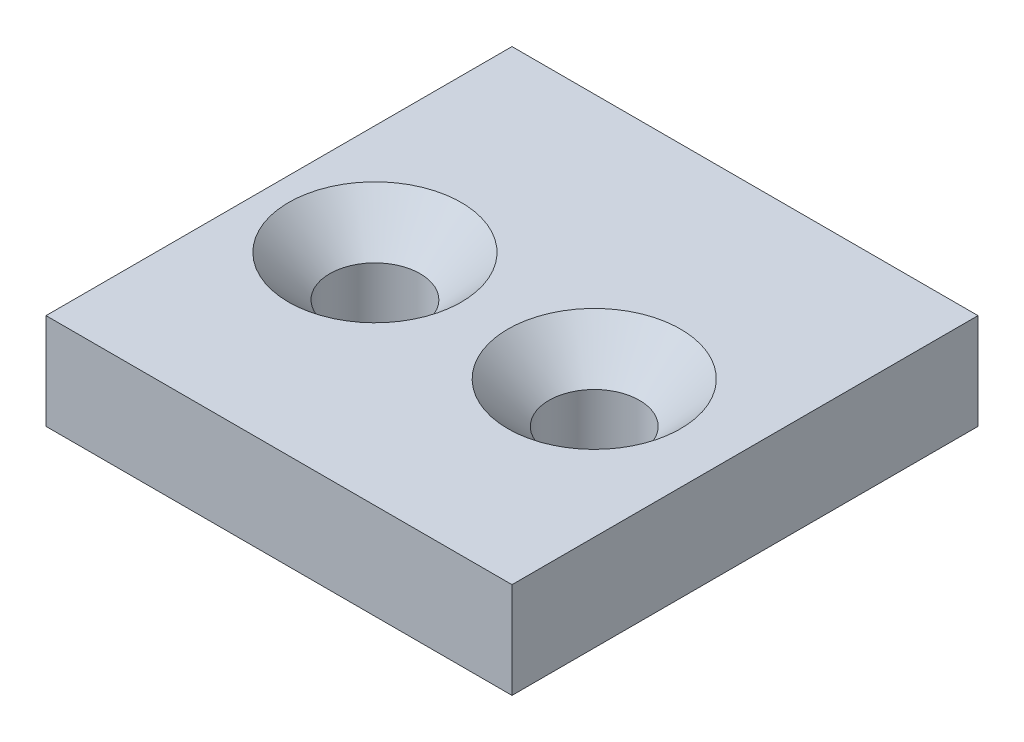
ISO-10303-21;
HEADER;
FILE_DESCRIPTION(('STEP AP214'),'2;1');
FILE_NAME('part.step','',(''),(''),'','','');
FILE_SCHEMA(('AUTOMOTIVE_DESIGN { 1 0 10303 214 1 1 1 1 }'));
ENDSEC;
DATA;
#1=APPLICATION_CONTEXT('core data for automotive mechanical design processes');
#2=APPLICATION_PROTOCOL_DEFINITION('international standard','automotive_design',2000,#1);
#3=PRODUCT_CONTEXT('',#1,'mechanical');
#4=PRODUCT('Part','Part','',(#3));
#5=PRODUCT_RELATED_PRODUCT_CATEGORY('part','',(#4));
#6=PRODUCT_DEFINITION_FORMATION('','',#4);
#7=PRODUCT_DEFINITION_CONTEXT('part definition',#1,'design');
#8=PRODUCT_DEFINITION('design','',#6,#7);
#9=PRODUCT_DEFINITION_SHAPE('','',#8);
#10=(LENGTH_UNIT() NAMED_UNIT(*) SI_UNIT(.MILLI.,.METRE.));
#11=(NAMED_UNIT(*) PLANE_ANGLE_UNIT() SI_UNIT($,.RADIAN.));
#12=(NAMED_UNIT(*) SI_UNIT($,.STERADIAN.) SOLID_ANGLE_UNIT());
#13=UNCERTAINTY_MEASURE_WITH_UNIT(LENGTH_MEASURE(1.E-05),#10,'distance_accuracy_value','');
#14=(GEOMETRIC_REPRESENTATION_CONTEXT(3) GLOBAL_UNCERTAINTY_ASSIGNED_CONTEXT((#13)) GLOBAL_UNIT_ASSIGNED_CONTEXT((#10,
#11,#12)) REPRESENTATION_CONTEXT('',''));
#15=CARTESIAN_POINT('',(0.,0.,0.));
#16=DIRECTION('',(0.,0.,1.));
#17=DIRECTION('',(1.,0.,0.));
#18=AXIS2_PLACEMENT_3D('',#15,#16,#17);
#19=CARTESIAN_POINT('',(0.,7.,0.));
#20=DIRECTION('',(0.,-1.,0.));
#21=DIRECTION('',(0.,0.,-1.));
#22=AXIS2_PLACEMENT_3D('',#19,#20,#21);
#23=PLANE('',#22);
#24=CARTESIAN_POINT('',(24.,7.,-16.));
#25=DIRECTION('',(0.,1.,0.));
#26=DIRECTION('',(0.,0.,1.));
#27=AXIS2_PLACEMENT_3D('',#24,#25,#26);
#28=CIRCLE('',#27,6.3);
#29=CARTESIAN_POINT('',(24.,7.,-9.7));
#30=VERTEX_POINT('',#29);
#31=EDGE_CURVE('E120',#30,#30,#28,.T.);
#32=ORIENTED_EDGE('',*,*,#31,.F.);
#33=EDGE_LOOP('',(#32));
#34=FACE_BOUND('',#33,.T.);
#35=DIRECTION('',(0.,0.,1.));
#36=VECTOR('',#35,1.);
#37=CARTESIAN_POINT('',(0.,7.,0.));
#38=LINE('',#37,#36);
#39=CARTESIAN_POINT('',(0.,7.,-34.));
#40=VERTEX_POINT('',#39);
#41=CARTESIAN_POINT('',(0.,7.,0.));
#42=VERTEX_POINT('',#41);
#43=EDGE_CURVE('E89',#40,#42,#38,.T.);
#44=ORIENTED_EDGE('',*,*,#43,.T.);
#45=DIRECTION('',(1.,0.,0.));
#46=VECTOR('',#45,1.);
#47=CARTESIAN_POINT('',(0.,7.,0.));
#48=LINE('',#47,#46);
#49=CARTESIAN_POINT('',(34.,7.,0.));
#50=VERTEX_POINT('',#49);
#51=EDGE_CURVE('E84',#42,#50,#48,.T.);
#52=ORIENTED_EDGE('',*,*,#51,.T.);
#53=DIRECTION('',(0.,0.,-1.));
#54=VECTOR('',#53,1.);
#55=CARTESIAN_POINT('',(34.,7.,0.));
#56=LINE('',#55,#54);
#57=CARTESIAN_POINT('',(34.,7.,-34.));
#58=VERTEX_POINT('',#57);
#59=EDGE_CURVE('E87',#50,#58,#56,.T.);
#60=ORIENTED_EDGE('',*,*,#59,.T.);
#61=DIRECTION('',(-1.,0.,0.));
#62=VECTOR('',#61,1.);
#63=CARTESIAN_POINT('',(0.,7.,-34.));
#64=LINE('',#63,#62);
#65=EDGE_CURVE('E54',#58,#40,#64,.T.);
#66=ORIENTED_EDGE('',*,*,#65,.T.);
#67=EDGE_LOOP('',(#44,#52,#60,#66));
#68=FACE_BOUND('',#67,.T.);
#69=CARTESIAN_POINT('',(8.,7.,-16.));
#70=DIRECTION('',(0.,1.,0.));
#71=DIRECTION('',(0.,0.,1.));
#72=AXIS2_PLACEMENT_3D('',#69,#70,#71);
#73=CIRCLE('',#72,6.3);
#74=CARTESIAN_POINT('',(8.,7.,-9.7));
#75=VERTEX_POINT('',#74);
#76=EDGE_CURVE('E129',#75,#75,#73,.T.);
#77=ORIENTED_EDGE('',*,*,#76,.F.);
#78=EDGE_LOOP('',(#77));
#79=FACE_BOUND('',#78,.T.);
#80=ADVANCED_FACE('F37',(#34,#68,#79),#23,.F.);
#81=CARTESIAN_POINT('',(0.,7.,0.));
#82=DIRECTION('',(1.,0.,0.));
#83=DIRECTION('',(0.,0.,-1.));
#84=AXIS2_PLACEMENT_3D('',#81,#82,#83);
#85=PLANE('',#84);
#86=DIRECTION('',(0.,0.,1.));
#87=VECTOR('',#86,1.);
#88=CARTESIAN_POINT('',(0.,0.,0.));
#89=LINE('',#88,#87);
#90=CARTESIAN_POINT('',(0.,0.,-34.));
#91=VERTEX_POINT('',#90);
#92=CARTESIAN_POINT('',(0.,0.,0.));
#93=VERTEX_POINT('',#92);
#94=EDGE_CURVE('E101',#91,#93,#89,.T.);
#95=ORIENTED_EDGE('',*,*,#94,.T.);
#96=DIRECTION('',(0.,-1.,0.));
#97=VECTOR('',#96,1.);
#98=CARTESIAN_POINT('',(0.,7.,0.));
#99=LINE('',#98,#97);
#100=EDGE_CURVE('E11',#42,#93,#99,.T.);
#101=ORIENTED_EDGE('',*,*,#100,.F.);
#102=ORIENTED_EDGE('',*,*,#43,.F.);
#103=DIRECTION('',(0.,-1.,0.));
#104=VECTOR('',#103,1.);
#105=CARTESIAN_POINT('',(0.,7.,-34.));
#106=LINE('',#105,#104);
#107=EDGE_CURVE('E97',#40,#91,#106,.T.);
#108=ORIENTED_EDGE('',*,*,#107,.T.);
#109=EDGE_LOOP('',(#95,#101,#102,#108));
#110=FACE_BOUND('',#109,.T.);
#111=ADVANCED_FACE('F39',(#110),#85,.F.);
#112=CARTESIAN_POINT('',(0.,7.,0.));
#113=DIRECTION('',(0.,0.,-1.));
#114=DIRECTION('',(-1.,0.,0.));
#115=AXIS2_PLACEMENT_3D('',#112,#113,#114);
#116=PLANE('',#115);
#117=DIRECTION('',(1.,0.,0.));
#118=VECTOR('',#117,1.);
#119=CARTESIAN_POINT('',(0.,0.,0.));
#120=LINE('',#119,#118);
#121=CARTESIAN_POINT('',(34.,0.,0.));
#122=VERTEX_POINT('',#121);
#123=EDGE_CURVE('E93',#93,#122,#120,.T.);
#124=ORIENTED_EDGE('',*,*,#123,.T.);
#125=DIRECTION('',(0.,-1.,0.));
#126=VECTOR('',#125,1.);
#127=CARTESIAN_POINT('',(34.,7.,0.));
#128=LINE('',#127,#126);
#129=EDGE_CURVE('E46',#50,#122,#128,.T.);
#130=ORIENTED_EDGE('',*,*,#129,.F.);
#131=ORIENTED_EDGE('',*,*,#51,.F.);
#132=ORIENTED_EDGE('',*,*,#100,.T.);
#133=EDGE_LOOP('',(#124,#130,#131,#132));
#134=FACE_BOUND('',#133,.T.);
#135=ADVANCED_FACE('F92',(#134),#116,.F.);
#136=CARTESIAN_POINT('',(34.,7.,0.));
#137=DIRECTION('',(-1.,0.,0.));
#138=DIRECTION('',(0.,0.,1.));
#139=AXIS2_PLACEMENT_3D('',#136,#137,#138);
#140=PLANE('',#139);
#141=DIRECTION('',(0.,0.,-1.));
#142=VECTOR('',#141,1.);
#143=CARTESIAN_POINT('',(34.,0.,0.));
#144=LINE('',#143,#142);
#145=CARTESIAN_POINT('',(34.,0.,-34.));
#146=VERTEX_POINT('',#145);
#147=EDGE_CURVE('E71',#122,#146,#144,.T.);
#148=ORIENTED_EDGE('',*,*,#147,.T.);
#149=DIRECTION('',(0.,-1.,0.));
#150=VECTOR('',#149,1.);
#151=CARTESIAN_POINT('',(34.,7.,-34.));
#152=LINE('',#151,#150);
#153=EDGE_CURVE('E94',#58,#146,#152,.T.);
#154=ORIENTED_EDGE('',*,*,#153,.F.);
#155=ORIENTED_EDGE('',*,*,#59,.F.);
#156=ORIENTED_EDGE('',*,*,#129,.T.);
#157=EDGE_LOOP('',(#148,#154,#155,#156));
#158=FACE_BOUND('',#157,.T.);
#159=ADVANCED_FACE('F95',(#158),#140,.F.);
#160=CARTESIAN_POINT('',(0.,7.,-34.));
#161=DIRECTION('',(0.,0.,1.));
#162=DIRECTION('',(1.,0.,0.));
#163=AXIS2_PLACEMENT_3D('',#160,#161,#162);
#164=PLANE('',#163);
#165=DIRECTION('',(-1.,0.,0.));
#166=VECTOR('',#165,1.);
#167=CARTESIAN_POINT('',(0.,0.,-34.));
#168=LINE('',#167,#166);
#169=EDGE_CURVE('E77',#146,#91,#168,.T.);
#170=ORIENTED_EDGE('',*,*,#169,.T.);
#171=ORIENTED_EDGE('',*,*,#107,.F.);
#172=ORIENTED_EDGE('',*,*,#65,.F.);
#173=ORIENTED_EDGE('',*,*,#153,.T.);
#174=EDGE_LOOP('',(#170,#171,#172,#173));
#175=FACE_BOUND('',#174,.T.);
#176=ADVANCED_FACE('F109',(#175),#164,.F.);
#177=CARTESIAN_POINT('',(0.,0.,0.));
#178=DIRECTION('',(0.,-1.,0.));
#179=DIRECTION('',(0.,0.,-1.));
#180=AXIS2_PLACEMENT_3D('',#177,#178,#179);
#181=PLANE('',#180);
#182=CARTESIAN_POINT('',(8.,0.,-16.));
#183=DIRECTION('',(0.,1.,0.));
#184=DIRECTION('',(0.,0.,1.));
#185=AXIS2_PLACEMENT_3D('',#182,#183,#184);
#186=CIRCLE('',#185,3.3);
#187=CARTESIAN_POINT('',(8.,0.,-12.7));
#188=VERTEX_POINT('',#187);
#189=EDGE_CURVE('E123',#188,#188,#186,.T.);
#190=ORIENTED_EDGE('',*,*,#189,.T.);
#191=EDGE_LOOP('',(#190));
#192=FACE_BOUND('',#191,.T.);
#193=CARTESIAN_POINT('',(24.,0.,-16.));
#194=DIRECTION('',(0.,1.,0.));
#195=DIRECTION('',(0.,0.,1.));
#196=AXIS2_PLACEMENT_3D('',#193,#194,#195);
#197=CIRCLE('',#196,3.3);
#198=CARTESIAN_POINT('',(24.,0.,-12.7));
#199=VERTEX_POINT('',#198);
#200=EDGE_CURVE('E104',#199,#199,#197,.T.);
#201=ORIENTED_EDGE('',*,*,#200,.T.);
#202=EDGE_LOOP('',(#201));
#203=FACE_BOUND('',#202,.T.);
#204=ORIENTED_EDGE('',*,*,#94,.F.);
#205=ORIENTED_EDGE('',*,*,#169,.F.);
#206=ORIENTED_EDGE('',*,*,#147,.F.);
#207=ORIENTED_EDGE('',*,*,#123,.F.);
#208=EDGE_LOOP('',(#204,#205,#206,#207));
#209=FACE_BOUND('',#208,.T.);
#210=ADVANCED_FACE('F112',(#192,#203,#209),#181,.T.);
#211=CARTESIAN_POINT('',(24.,7.,-16.));
#212=DIRECTION('',(0.,1.,0.));
#213=DIRECTION('',(0.,0.,1.));
#214=AXIS2_PLACEMENT_3D('',#211,#212,#213);
#215=CYLINDRICAL_SURFACE('',#214,3.3);
#216=ORIENTED_EDGE('',*,*,#200,.F.);
#217=EDGE_LOOP('',(#216));
#218=FACE_BOUND('',#217,.T.);
#219=CARTESIAN_POINT('',(24.,4.,-16.));
#220=DIRECTION('',(0.,1.,0.));
#221=DIRECTION('',(0.,0.,1.));
#222=AXIS2_PLACEMENT_3D('',#219,#220,#221);
#223=CIRCLE('',#222,3.3);
#224=CARTESIAN_POINT('',(24.,4.,-12.7));
#225=VERTEX_POINT('',#224);
#226=EDGE_CURVE('E117',#225,#225,#223,.T.);
#227=ORIENTED_EDGE('',*,*,#226,.T.);
#228=EDGE_LOOP('',(#227));
#229=FACE_BOUND('',#228,.T.);
#230=ADVANCED_FACE('F143',(#218,#229),#215,.F.);
#231=CARTESIAN_POINT('',(24.,7.,-16.));
#232=DIRECTION('',(0.,1.,0.));
#233=DIRECTION('',(0.,0.,1.));
#234=AXIS2_PLACEMENT_3D('',#231,#232,#233);
#235=CONICAL_SURFACE('',#234,6.3,0.785398163397448);
#236=ORIENTED_EDGE('',*,*,#226,.F.);
#237=EDGE_LOOP('',(#236));
#238=FACE_BOUND('',#237,.T.);
#239=ORIENTED_EDGE('',*,*,#31,.T.);
#240=EDGE_LOOP('',(#239));
#241=FACE_BOUND('',#240,.T.);
#242=ADVANCED_FACE('F174',(#238,#241),#235,.F.);
#243=CARTESIAN_POINT('',(8.,7.,-16.));
#244=DIRECTION('',(0.,1.,0.));
#245=DIRECTION('',(0.,0.,1.));
#246=AXIS2_PLACEMENT_3D('',#243,#244,#245);
#247=CYLINDRICAL_SURFACE('',#246,3.3);
#248=ORIENTED_EDGE('',*,*,#189,.F.);
#249=EDGE_LOOP('',(#248));
#250=FACE_BOUND('',#249,.T.);
#251=CARTESIAN_POINT('',(8.,4.,-16.));
#252=DIRECTION('',(0.,1.,0.));
#253=DIRECTION('',(0.,0.,1.));
#254=AXIS2_PLACEMENT_3D('',#251,#252,#253);
#255=CIRCLE('',#254,3.3);
#256=CARTESIAN_POINT('',(8.,4.,-12.7));
#257=VERTEX_POINT('',#256);
#258=EDGE_CURVE('E126',#257,#257,#255,.T.);
#259=ORIENTED_EDGE('',*,*,#258,.T.);
#260=EDGE_LOOP('',(#259));
#261=FACE_BOUND('',#260,.T.);
#262=ADVANCED_FACE('F181',(#250,#261),#247,.F.);
#263=CARTESIAN_POINT('',(8.,7.,-16.));
#264=DIRECTION('',(0.,1.,0.));
#265=DIRECTION('',(0.,0.,1.));
#266=AXIS2_PLACEMENT_3D('',#263,#264,#265);
#267=CONICAL_SURFACE('',#266,6.3,0.785398163397448);
#268=ORIENTED_EDGE('',*,*,#258,.F.);
#269=EDGE_LOOP('',(#268));
#270=FACE_BOUND('',#269,.T.);
#271=ORIENTED_EDGE('',*,*,#76,.T.);
#272=EDGE_LOOP('',(#271));
#273=FACE_BOUND('',#272,.T.);
#274=ADVANCED_FACE('F133',(#270,#273),#267,.F.);
#275=CLOSED_SHELL('',(#80,#111,#135,#159,#176,#210,#230,#242,#262,#274));
#276=MANIFOLD_SOLID_BREP('B2',#275);
#277=ADVANCED_BREP_SHAPE_REPRESENTATION('',(#18,#276),#14);
#278=SHAPE_DEFINITION_REPRESENTATION(#9,#277);
ENDSEC;
END-ISO-10303-21;
